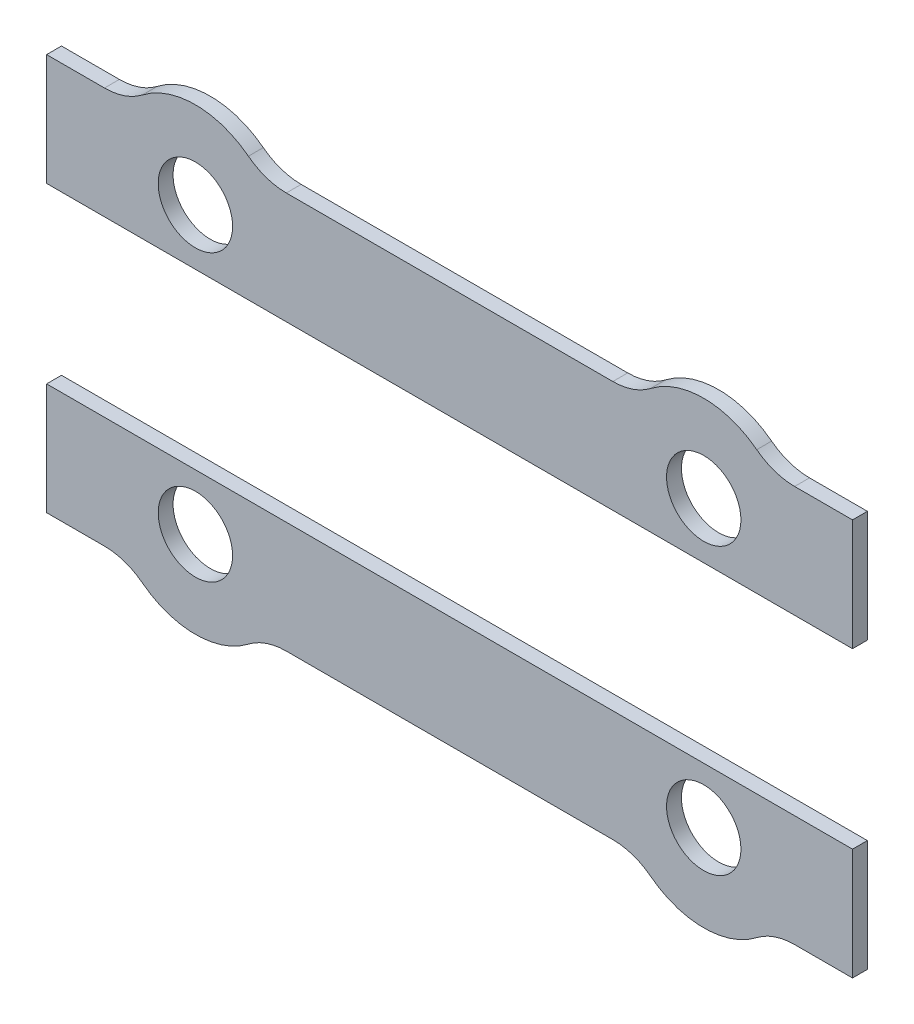
ISO-10303-21;
HEADER;
FILE_DESCRIPTION(('STEP AP214'),'2;1');
FILE_NAME('part.step','',(''),(''),'','','');
FILE_SCHEMA(('AUTOMOTIVE_DESIGN { 1 0 10303 214 1 1 1 1 }'));
ENDSEC;
DATA;
#1=APPLICATION_CONTEXT('core data for automotive mechanical design processes');
#2=APPLICATION_PROTOCOL_DEFINITION('international standard','automotive_design',2000,#1);
#3=PRODUCT_CONTEXT('',#1,'mechanical');
#4=PRODUCT('Part','Part','',(#3));
#5=PRODUCT_RELATED_PRODUCT_CATEGORY('part','',(#4));
#6=PRODUCT_DEFINITION_FORMATION('','',#4);
#7=PRODUCT_DEFINITION_CONTEXT('part definition',#1,'design');
#8=PRODUCT_DEFINITION('design','',#6,#7);
#9=PRODUCT_DEFINITION_SHAPE('','',#8);
#10=(LENGTH_UNIT() NAMED_UNIT(*) SI_UNIT(.MILLI.,.METRE.));
#11=(NAMED_UNIT(*) PLANE_ANGLE_UNIT() SI_UNIT($,.RADIAN.));
#12=(NAMED_UNIT(*) SI_UNIT($,.STERADIAN.) SOLID_ANGLE_UNIT());
#13=UNCERTAINTY_MEASURE_WITH_UNIT(LENGTH_MEASURE(1.E-05),#10,'distance_accuracy_value','');
#14=(GEOMETRIC_REPRESENTATION_CONTEXT(3) GLOBAL_UNCERTAINTY_ASSIGNED_CONTEXT((#13)) GLOBAL_UNIT_ASSIGNED_CONTEXT((#10,
#11,#12)) REPRESENTATION_CONTEXT('',''));
#15=CARTESIAN_POINT('',(0.,0.,0.));
#16=DIRECTION('',(0.,0.,1.));
#17=DIRECTION('',(1.,0.,0.));
#18=AXIS2_PLACEMENT_3D('',#15,#16,#17);
#19=CARTESIAN_POINT('',(2.33428042534615,-2.5000000000001,0.600000000000001));
#20=DIRECTION('',(0.,0.,-1.));
#21=DIRECTION('',(-1.,0.,0.));
#22=AXIS2_PLACEMENT_3D('',#19,#20,#21);
#23=CYLINDRICAL_SURFACE('',#22,2.50000000000005);
#24=CARTESIAN_POINT('',(2.33428042534615,-2.5000000000001,0.));
#25=DIRECTION('',(0.,0.,1.));
#26=DIRECTION('',(1.,0.,0.));
#27=AXIS2_PLACEMENT_3D('',#24,#25,#26);
#28=CIRCLE('',#27,2.50000000000005);
#29=CARTESIAN_POINT('',(2.33428042534621,0.,0.));
#30=VERTEX_POINT('',#29);
#31=CARTESIAN_POINT('',(3.86166358145177,-0.520833333333284,0.));
#32=VERTEX_POINT('',#31);
#33=EDGE_CURVE('E175',#30,#32,#28,.F.);
#34=ORIENTED_EDGE('',*,*,#33,.T.);
#35=DIRECTION('',(0.,0.,-1.));
#36=VECTOR('',#35,1.);
#37=CARTESIAN_POINT('',(3.86166358145177,-0.520833333333284,0.600000000000001));
#38=LINE('',#37,#36);
#39=CARTESIAN_POINT('',(3.86166358145177,-0.520833333333284,0.600000000000001));
#40=VERTEX_POINT('',#39);
#41=EDGE_CURVE('E12',#40,#32,#38,.T.);
#42=ORIENTED_EDGE('',*,*,#41,.F.);
#43=CARTESIAN_POINT('',(2.33428042534615,-2.5000000000001,0.600000000000001));
#44=DIRECTION('',(0.,0.,1.));
#45=DIRECTION('',(1.,0.,0.));
#46=AXIS2_PLACEMENT_3D('',#43,#44,#45);
#47=CIRCLE('',#46,2.50000000000005);
#48=CARTESIAN_POINT('',(2.33428042534621,0.,0.600000000000001));
#49=VERTEX_POINT('',#48);
#50=EDGE_CURVE('E114',#49,#40,#47,.F.);
#51=ORIENTED_EDGE('',*,*,#50,.F.);
#52=DIRECTION('',(0.,0.,-1.));
#53=VECTOR('',#52,1.);
#54=CARTESIAN_POINT('',(2.33428042534621,0.,0.600000000000001));
#55=LINE('',#54,#53);
#56=EDGE_CURVE('E171',#49,#30,#55,.T.);
#57=ORIENTED_EDGE('',*,*,#56,.T.);
#58=EDGE_LOOP('',(#34,#42,#51,#57));
#59=FACE_BOUND('',#58,.T.);
#60=ADVANCED_FACE('F46',(#59),#23,.F.);
#61=CARTESIAN_POINT('',(5.99999999999988,2.25000000000057,0.600000000000001));
#62=DIRECTION('',(0.,0.,-1.));
#63=DIRECTION('',(-1.,0.,0.));
#64=AXIS2_PLACEMENT_3D('',#61,#62,#63);
#65=CYLINDRICAL_SURFACE('',#64,3.50000000000045);
#66=CARTESIAN_POINT('',(5.99999999999988,2.25000000000057,0.));
#67=DIRECTION('',(0.,0.,1.));
#68=DIRECTION('',(1.,0.,0.));
#69=AXIS2_PLACEMENT_3D('',#66,#67,#68);
#70=CIRCLE('',#69,3.50000000000045);
#71=CARTESIAN_POINT('',(8.13833641854802,-0.520833333333259,0.));
#72=VERTEX_POINT('',#71);
#73=EDGE_CURVE('E178',#72,#32,#70,.F.);
#74=ORIENTED_EDGE('',*,*,#73,.F.);
#75=DIRECTION('',(0.,0.,-1.));
#76=VECTOR('',#75,1.);
#77=CARTESIAN_POINT('',(8.13833641854802,-0.520833333333259,0.600000000000001));
#78=LINE('',#77,#76);
#79=CARTESIAN_POINT('',(8.13833641854802,-0.520833333333259,0.600000000000001));
#80=VERTEX_POINT('',#79);
#81=EDGE_CURVE('E55',#80,#72,#78,.T.);
#82=ORIENTED_EDGE('',*,*,#81,.F.);
#83=CARTESIAN_POINT('',(5.99999999999988,2.25000000000057,0.600000000000001));
#84=DIRECTION('',(0.,0.,1.));
#85=DIRECTION('',(1.,0.,0.));
#86=AXIS2_PLACEMENT_3D('',#83,#84,#85);
#87=CIRCLE('',#86,3.50000000000045);
#88=EDGE_CURVE('E364',#80,#40,#87,.F.);
#89=ORIENTED_EDGE('',*,*,#88,.T.);
#90=ORIENTED_EDGE('',*,*,#41,.T.);
#91=EDGE_LOOP('',(#74,#82,#89,#90));
#92=FACE_BOUND('',#91,.T.);
#93=ADVANCED_FACE('F232',(#92),#65,.T.);
#94=CARTESIAN_POINT('',(9.66571957465385,-2.5000000000003,0.600000000000001));
#95=DIRECTION('',(0.,0.,-1.));
#96=DIRECTION('',(-1.,0.,0.));
#97=AXIS2_PLACEMENT_3D('',#94,#95,#96);
#98=CYLINDRICAL_SURFACE('',#97,2.50000000000034);
#99=CARTESIAN_POINT('',(9.66571957465385,-2.5000000000003,0.));
#100=DIRECTION('',(0.,0.,1.));
#101=DIRECTION('',(1.,0.,0.));
#102=AXIS2_PLACEMENT_3D('',#99,#100,#101);
#103=CIRCLE('',#102,2.50000000000034);
#104=CARTESIAN_POINT('',(9.66571957465385,0.,0.));
#105=VERTEX_POINT('',#104);
#106=EDGE_CURVE('E181',#105,#72,#103,.T.);
#107=ORIENTED_EDGE('',*,*,#106,.F.);
#108=DIRECTION('',(0.,0.,-1.));
#109=VECTOR('',#108,1.);
#110=CARTESIAN_POINT('',(9.66571957465385,0.,0.600000000000001));
#111=LINE('',#110,#109);
#112=CARTESIAN_POINT('',(9.66571957465385,0.,0.600000000000001));
#113=VERTEX_POINT('',#112);
#114=EDGE_CURVE('E222',#113,#105,#111,.T.);
#115=ORIENTED_EDGE('',*,*,#114,.F.);
#116=CARTESIAN_POINT('',(9.66571957465385,-2.5000000000003,0.600000000000001));
#117=DIRECTION('',(0.,0.,1.));
#118=DIRECTION('',(1.,0.,0.));
#119=AXIS2_PLACEMENT_3D('',#116,#117,#118);
#120=CIRCLE('',#119,2.50000000000034);
#121=EDGE_CURVE('E229',#113,#80,#120,.T.);
#122=ORIENTED_EDGE('',*,*,#121,.T.);
#123=ORIENTED_EDGE('',*,*,#81,.T.);
#124=EDGE_LOOP('',(#107,#115,#122,#123));
#125=FACE_BOUND('',#124,.T.);
#126=ADVANCED_FACE('F227',(#125),#98,.F.);
#127=CARTESIAN_POINT('',(0.,0.,0.600000000000001));
#128=DIRECTION('',(0.,1.,0.));
#129=DIRECTION('',(-1.,0.,0.));
#130=AXIS2_PLACEMENT_3D('',#127,#128,#129);
#131=PLANE('',#130);
#132=DIRECTION('',(1.,0.,0.));
#133=VECTOR('',#132,1.);
#134=CARTESIAN_POINT('',(0.,0.,0.));
#135=LINE('',#134,#133);
#136=CARTESIAN_POINT('',(22.8342804346538,0.,0.));
#137=VERTEX_POINT('',#136);
#138=EDGE_CURVE('E184',#105,#137,#135,.T.);
#139=ORIENTED_EDGE('',*,*,#138,.T.);
#140=DIRECTION('',(0.,0.,-1.));
#141=VECTOR('',#140,1.);
#142=CARTESIAN_POINT('',(22.8342804346538,0.,0.600000000000001));
#143=LINE('',#142,#141);
#144=CARTESIAN_POINT('',(22.8342804346538,0.,0.600000000000001));
#145=VERTEX_POINT('',#144);
#146=EDGE_CURVE('E219',#145,#137,#143,.T.);
#147=ORIENTED_EDGE('',*,*,#146,.F.);
#148=DIRECTION('',(1.,0.,0.));
#149=VECTOR('',#148,1.);
#150=CARTESIAN_POINT('',(0.,0.,0.600000000000001));
#151=LINE('',#150,#149);
#152=EDGE_CURVE('E251',#113,#145,#151,.T.);
#153=ORIENTED_EDGE('',*,*,#152,.F.);
#154=ORIENTED_EDGE('',*,*,#114,.T.);
#155=EDGE_LOOP('',(#139,#147,#153,#154));
#156=FACE_BOUND('',#155,.T.);
#157=ADVANCED_FACE('F242',(#156),#131,.F.);
#158=CARTESIAN_POINT('',(22.8342804346538,-2.50000000000031,0.600000000000001));
#159=DIRECTION('',(0.,0.,-1.));
#160=DIRECTION('',(-1.,0.,0.));
#161=AXIS2_PLACEMENT_3D('',#158,#159,#160);
#162=CYLINDRICAL_SURFACE('',#161,2.50000000000034);
#163=CARTESIAN_POINT('',(22.8342804346538,-2.50000000000031,0.));
#164=DIRECTION('',(0.,0.,1.));
#165=DIRECTION('',(1.,0.,0.));
#166=AXIS2_PLACEMENT_3D('',#163,#164,#165);
#167=CIRCLE('',#166,2.50000000000034);
#168=CARTESIAN_POINT('',(24.3616635907597,-0.520833333333261,0.));
#169=VERTEX_POINT('',#168);
#170=EDGE_CURVE('E186',#137,#169,#167,.F.);
#171=ORIENTED_EDGE('',*,*,#170,.T.);
#172=DIRECTION('',(0.,0.,-1.));
#173=VECTOR('',#172,1.);
#174=CARTESIAN_POINT('',(24.3616635907597,-0.520833333333261,0.600000000000001));
#175=LINE('',#174,#173);
#176=CARTESIAN_POINT('',(24.3616635907597,-0.520833333333261,0.600000000000001));
#177=VERTEX_POINT('',#176);
#178=EDGE_CURVE('E216',#177,#169,#175,.T.);
#179=ORIENTED_EDGE('',*,*,#178,.F.);
#180=CARTESIAN_POINT('',(22.8342804346538,-2.50000000000031,0.600000000000001));
#181=DIRECTION('',(0.,0.,1.));
#182=DIRECTION('',(1.,0.,0.));
#183=AXIS2_PLACEMENT_3D('',#180,#181,#182);
#184=CIRCLE('',#183,2.50000000000034);
#185=EDGE_CURVE('E248',#145,#177,#184,.F.);
#186=ORIENTED_EDGE('',*,*,#185,.F.);
#187=ORIENTED_EDGE('',*,*,#146,.T.);
#188=EDGE_LOOP('',(#171,#179,#186,#187));
#189=FACE_BOUND('',#188,.T.);
#190=ADVANCED_FACE('F246',(#189),#162,.F.);
#191=CARTESIAN_POINT('',(26.5000000093078,2.25000000000057,0.600000000000001));
#192=DIRECTION('',(0.,0.,-1.));
#193=DIRECTION('',(-1.,0.,0.));
#194=AXIS2_PLACEMENT_3D('',#191,#192,#193);
#195=CYLINDRICAL_SURFACE('',#194,3.50000000000045);
#196=CARTESIAN_POINT('',(26.5000000093078,2.25000000000057,0.));
#197=DIRECTION('',(0.,0.,1.));
#198=DIRECTION('',(1.,0.,0.));
#199=AXIS2_PLACEMENT_3D('',#196,#197,#198);
#200=CIRCLE('',#199,3.50000000000045);
#201=CARTESIAN_POINT('',(28.6383364278559,-0.520833333333277,0.));
#202=VERTEX_POINT('',#201);
#203=EDGE_CURVE('E188',#169,#202,#200,.T.);
#204=ORIENTED_EDGE('',*,*,#203,.T.);
#205=DIRECTION('',(0.,0.,-1.));
#206=VECTOR('',#205,1.);
#207=CARTESIAN_POINT('',(28.6383364278559,-0.520833333333277,0.600000000000001));
#208=LINE('',#207,#206);
#209=CARTESIAN_POINT('',(28.6383364278559,-0.520833333333277,0.600000000000001));
#210=VERTEX_POINT('',#209);
#211=EDGE_CURVE('E214',#210,#202,#208,.T.);
#212=ORIENTED_EDGE('',*,*,#211,.F.);
#213=CARTESIAN_POINT('',(26.5000000093078,2.25000000000057,0.600000000000001));
#214=DIRECTION('',(0.,0.,1.));
#215=DIRECTION('',(1.,0.,0.));
#216=AXIS2_PLACEMENT_3D('',#213,#214,#215);
#217=CIRCLE('',#216,3.50000000000045);
#218=EDGE_CURVE('E250',#177,#210,#217,.T.);
#219=ORIENTED_EDGE('',*,*,#218,.F.);
#220=ORIENTED_EDGE('',*,*,#178,.T.);
#221=EDGE_LOOP('',(#204,#212,#219,#220));
#222=FACE_BOUND('',#221,.T.);
#223=ADVANCED_FACE('F292',(#222),#195,.T.);
#224=CARTESIAN_POINT('',(30.1657195839615,-2.50000000000009,0.600000000000001));
#225=DIRECTION('',(0.,0.,-1.));
#226=DIRECTION('',(-1.,0.,0.));
#227=AXIS2_PLACEMENT_3D('',#224,#225,#226);
#228=CYLINDRICAL_SURFACE('',#227,2.50000000000004);
#229=CARTESIAN_POINT('',(30.1657195839615,-2.50000000000009,0.));
#230=DIRECTION('',(0.,0.,1.));
#231=DIRECTION('',(1.,0.,0.));
#232=AXIS2_PLACEMENT_3D('',#229,#230,#231);
#233=CIRCLE('',#232,2.50000000000004);
#234=CARTESIAN_POINT('',(30.1657195839615,0.,0.));
#235=VERTEX_POINT('',#234);
#236=EDGE_CURVE('E191',#235,#202,#233,.T.);
#237=ORIENTED_EDGE('',*,*,#236,.F.);
#238=DIRECTION('',(0.,0.,-1.));
#239=VECTOR('',#238,1.);
#240=CARTESIAN_POINT('',(30.1657195839615,0.,0.600000000000001));
#241=LINE('',#240,#239);
#242=CARTESIAN_POINT('',(30.1657195839615,0.,0.600000000000001));
#243=VERTEX_POINT('',#242);
#244=EDGE_CURVE('E212',#243,#235,#241,.T.);
#245=ORIENTED_EDGE('',*,*,#244,.F.);
#246=CARTESIAN_POINT('',(30.1657195839615,-2.50000000000009,0.600000000000001));
#247=DIRECTION('',(0.,0.,1.));
#248=DIRECTION('',(1.,0.,0.));
#249=AXIS2_PLACEMENT_3D('',#246,#247,#248);
#250=CIRCLE('',#249,2.50000000000004);
#251=EDGE_CURVE('E253',#243,#210,#250,.T.);
#252=ORIENTED_EDGE('',*,*,#251,.T.);
#253=ORIENTED_EDGE('',*,*,#211,.T.);
#254=EDGE_LOOP('',(#237,#245,#252,#253));
#255=FACE_BOUND('',#254,.T.);
#256=ADVANCED_FACE('F295',(#255),#228,.F.);
#257=CARTESIAN_POINT('',(0.,-6.76267661095971E-13,0.600000000000001));
#258=DIRECTION('',(0.,-1.,0.));
#259=DIRECTION('',(1.,0.,0.));
#260=AXIS2_PLACEMENT_3D('',#257,#258,#259);
#261=PLANE('',#260);
#262=DIRECTION('',(-1.,0.,0.));
#263=VECTOR('',#262,1.);
#264=CARTESIAN_POINT('',(0.,-6.76267661095971E-13,0.));
#265=LINE('',#264,#263);
#266=CARTESIAN_POINT('',(32.5000000093077,0.,0.));
#267=VERTEX_POINT('',#266);
#268=EDGE_CURVE('E194',#267,#235,#265,.T.);
#269=ORIENTED_EDGE('',*,*,#268,.F.);
#270=DIRECTION('',(0.,0.,-1.));
#271=VECTOR('',#270,1.);
#272=CARTESIAN_POINT('',(32.5000000093077,0.,0.600000000000001));
#273=LINE('',#272,#271);
#274=CARTESIAN_POINT('',(32.5000000093077,0.,0.600000000000001));
#275=VERTEX_POINT('',#274);
#276=EDGE_CURVE('E210',#275,#267,#273,.T.);
#277=ORIENTED_EDGE('',*,*,#276,.F.);
#278=DIRECTION('',(-1.,0.,0.));
#279=VECTOR('',#278,1.);
#280=CARTESIAN_POINT('',(0.,-6.76267661095971E-13,0.600000000000001));
#281=LINE('',#280,#279);
#282=EDGE_CURVE('E163',#275,#243,#281,.T.);
#283=ORIENTED_EDGE('',*,*,#282,.T.);
#284=ORIENTED_EDGE('',*,*,#244,.T.);
#285=EDGE_LOOP('',(#269,#277,#283,#284));
#286=FACE_BOUND('',#285,.T.);
#287=ADVANCED_FACE('F262',(#286),#261,.T.);
#288=CARTESIAN_POINT('',(32.5000000093077,0.,0.600000000000001));
#289=DIRECTION('',(1.,0.,0.));
#290=DIRECTION('',(0.,0.,-1.));
#291=AXIS2_PLACEMENT_3D('',#288,#289,#290);
#292=PLANE('',#291);
#293=DIRECTION('',(0.,-1.,0.));
#294=VECTOR('',#293,1.);
#295=CARTESIAN_POINT('',(32.5000000093077,0.,0.));
#296=LINE('',#295,#294);
#297=CARTESIAN_POINT('',(32.5000000093077,4.5,0.));
#298=VERTEX_POINT('',#297);
#299=EDGE_CURVE('E197',#298,#267,#296,.T.);
#300=ORIENTED_EDGE('',*,*,#299,.F.);
#301=DIRECTION('',(0.,0.,-1.));
#302=VECTOR('',#301,1.);
#303=CARTESIAN_POINT('',(32.5000000093077,4.5,0.600000000000001));
#304=LINE('',#303,#302);
#305=CARTESIAN_POINT('',(32.5000000093077,4.5,0.600000000000001));
#306=VERTEX_POINT('',#305);
#307=EDGE_CURVE('E150',#306,#298,#304,.T.);
#308=ORIENTED_EDGE('',*,*,#307,.F.);
#309=DIRECTION('',(0.,-1.,0.));
#310=VECTOR('',#309,1.);
#311=CARTESIAN_POINT('',(32.5000000093077,0.,0.600000000000001));
#312=LINE('',#311,#310);
#313=EDGE_CURVE('E161',#306,#275,#312,.T.);
#314=ORIENTED_EDGE('',*,*,#313,.T.);
#315=ORIENTED_EDGE('',*,*,#276,.T.);
#316=EDGE_LOOP('',(#300,#308,#314,#315));
#317=FACE_BOUND('',#316,.T.);
#318=ADVANCED_FACE('F267',(#317),#292,.T.);
#319=CARTESIAN_POINT('',(0.,4.5,0.600000000000001));
#320=DIRECTION('',(0.,1.,0.));
#321=DIRECTION('',(0.,0.,1.));
#322=AXIS2_PLACEMENT_3D('',#319,#320,#321);
#323=PLANE('',#322);
#324=DIRECTION('',(1.,0.,0.));
#325=VECTOR('',#324,1.);
#326=CARTESIAN_POINT('',(0.,4.5,0.));
#327=LINE('',#326,#325);
#328=CARTESIAN_POINT('',(0.,4.5,0.));
#329=VERTEX_POINT('',#328);
#330=EDGE_CURVE('E149',#329,#298,#327,.T.);
#331=ORIENTED_EDGE('',*,*,#330,.F.);
#332=DIRECTION('',(0.,0.,-1.));
#333=VECTOR('',#332,1.);
#334=CARTESIAN_POINT('',(0.,4.5,0.600000000000001));
#335=LINE('',#334,#333);
#336=CARTESIAN_POINT('',(0.,4.5,0.600000000000001));
#337=VERTEX_POINT('',#336);
#338=EDGE_CURVE('E143',#337,#329,#335,.T.);
#339=ORIENTED_EDGE('',*,*,#338,.F.);
#340=DIRECTION('',(1.,0.,0.));
#341=VECTOR('',#340,1.);
#342=CARTESIAN_POINT('',(0.,4.5,0.600000000000001));
#343=LINE('',#342,#341);
#344=EDGE_CURVE('E147',#337,#306,#343,.T.);
#345=ORIENTED_EDGE('',*,*,#344,.T.);
#346=ORIENTED_EDGE('',*,*,#307,.T.);
#347=EDGE_LOOP('',(#331,#339,#345,#346));
#348=FACE_BOUND('',#347,.T.);
#349=ADVANCED_FACE('F145',(#348),#323,.T.);
#350=CARTESIAN_POINT('',(0.,0.,0.600000000000001));
#351=DIRECTION('',(1.,0.,0.));
#352=DIRECTION('',(0.,0.,-1.));
#353=AXIS2_PLACEMENT_3D('',#350,#351,#352);
#354=PLANE('',#353);
#355=DIRECTION('',(0.,-1.,0.));
#356=VECTOR('',#355,1.);
#357=CARTESIAN_POINT('',(0.,0.,0.));
#358=LINE('',#357,#356);
#359=CARTESIAN_POINT('',(0.,0.,0.));
#360=VERTEX_POINT('',#359);
#361=EDGE_CURVE('E102',#329,#360,#358,.T.);
#362=ORIENTED_EDGE('',*,*,#361,.T.);
#363=DIRECTION('',(0.,0.,-1.));
#364=VECTOR('',#363,1.);
#365=CARTESIAN_POINT('',(0.,0.,0.600000000000001));
#366=LINE('',#365,#364);
#367=CARTESIAN_POINT('',(0.,0.,0.600000000000001));
#368=VERTEX_POINT('',#367);
#369=EDGE_CURVE('E151',#368,#360,#366,.T.);
#370=ORIENTED_EDGE('',*,*,#369,.F.);
#371=DIRECTION('',(0.,-1.,0.));
#372=VECTOR('',#371,1.);
#373=CARTESIAN_POINT('',(0.,0.,0.600000000000001));
#374=LINE('',#373,#372);
#375=EDGE_CURVE('E153',#337,#368,#374,.T.);
#376=ORIENTED_EDGE('',*,*,#375,.F.);
#377=ORIENTED_EDGE('',*,*,#338,.T.);
#378=EDGE_LOOP('',(#362,#370,#376,#377));
#379=FACE_BOUND('',#378,.T.);
#380=ADVANCED_FACE('F154',(#379),#354,.F.);
#381=CARTESIAN_POINT('',(0.,0.,0.600000000000001));
#382=DIRECTION('',(0.,1.,0.));
#383=DIRECTION('',(-1.,0.,0.));
#384=AXIS2_PLACEMENT_3D('',#381,#382,#383);
#385=PLANE('',#384);
#386=DIRECTION('',(1.,0.,0.));
#387=VECTOR('',#386,1.);
#388=CARTESIAN_POINT('',(0.,0.,0.));
#389=LINE('',#388,#387);
#390=EDGE_CURVE('E108',#360,#30,#389,.T.);
#391=ORIENTED_EDGE('',*,*,#390,.T.);
#392=ORIENTED_EDGE('',*,*,#56,.F.);
#393=DIRECTION('',(1.,0.,0.));
#394=VECTOR('',#393,1.);
#395=CARTESIAN_POINT('',(0.,0.,0.600000000000001));
#396=LINE('',#395,#394);
#397=EDGE_CURVE('E63',#368,#49,#396,.T.);
#398=ORIENTED_EDGE('',*,*,#397,.F.);
#399=ORIENTED_EDGE('',*,*,#369,.T.);
#400=EDGE_LOOP('',(#391,#392,#398,#399));
#401=FACE_BOUND('',#400,.T.);
#402=ADVANCED_FACE('F269',(#401),#385,.F.);
#403=CARTESIAN_POINT('',(5.99999999999988,2.25000000000057,0.600000000000001));
#404=DIRECTION('',(0.,0.,-1.));
#405=DIRECTION('',(-1.,0.,0.));
#406=AXIS2_PLACEMENT_3D('',#403,#404,#405);
#407=CYLINDRICAL_SURFACE('',#406,1.5);
#408=CARTESIAN_POINT('',(5.99999999999988,2.25000000000057,0.600000000000001));
#409=DIRECTION('',(0.,0.,1.));
#410=DIRECTION('',(1.,0.,0.));
#411=AXIS2_PLACEMENT_3D('',#408,#409,#410);
#412=CIRCLE('',#411,1.5);
#413=CARTESIAN_POINT('',(7.49999999999988,2.25000000000057,0.600000000000001));
#414=VERTEX_POINT('',#413);
#415=EDGE_CURVE('E206',#414,#414,#412,.T.);
#416=ORIENTED_EDGE('',*,*,#415,.T.);
#417=EDGE_LOOP('',(#416));
#418=FACE_BOUND('',#417,.T.);
#419=CARTESIAN_POINT('',(5.99999999999988,2.25000000000057,0.));
#420=DIRECTION('',(0.,0.,1.));
#421=DIRECTION('',(1.,0.,0.));
#422=AXIS2_PLACEMENT_3D('',#419,#420,#421);
#423=CIRCLE('',#422,1.5);
#424=CARTESIAN_POINT('',(7.49999999999988,2.25000000000057,0.));
#425=VERTEX_POINT('',#424);
#426=EDGE_CURVE('E172',#425,#425,#423,.T.);
#427=ORIENTED_EDGE('',*,*,#426,.F.);
#428=EDGE_LOOP('',(#427));
#429=FACE_BOUND('',#428,.T.);
#430=ADVANCED_FACE('F48',(#418,#429),#407,.F.);
#431=CARTESIAN_POINT('',(26.5000000093078,2.25000000000057,0.600000000000001));
#432=DIRECTION('',(0.,0.,-1.));
#433=DIRECTION('',(-1.,0.,0.));
#434=AXIS2_PLACEMENT_3D('',#431,#432,#433);
#435=CYLINDRICAL_SURFACE('',#434,1.5);
#436=CARTESIAN_POINT('',(26.5000000093078,2.25000000000057,0.600000000000001));
#437=DIRECTION('',(0.,0.,1.));
#438=DIRECTION('',(1.,0.,0.));
#439=AXIS2_PLACEMENT_3D('',#436,#437,#438);
#440=CIRCLE('',#439,1.5);
#441=CARTESIAN_POINT('',(28.0000000093078,2.25000000000057,0.600000000000001));
#442=VERTEX_POINT('',#441);
#443=EDGE_CURVE('E168',#442,#442,#440,.F.);
#444=ORIENTED_EDGE('',*,*,#443,.F.);
#445=EDGE_LOOP('',(#444));
#446=FACE_BOUND('',#445,.T.);
#447=CARTESIAN_POINT('',(26.5000000093078,2.25000000000057,0.));
#448=DIRECTION('',(0.,0.,1.));
#449=DIRECTION('',(1.,0.,0.));
#450=AXIS2_PLACEMENT_3D('',#447,#448,#449);
#451=CIRCLE('',#450,1.5);
#452=CARTESIAN_POINT('',(28.0000000093078,2.25000000000057,0.));
#453=VERTEX_POINT('',#452);
#454=EDGE_CURVE('E203',#453,#453,#451,.F.);
#455=ORIENTED_EDGE('',*,*,#454,.T.);
#456=EDGE_LOOP('',(#455));
#457=FACE_BOUND('',#456,.T.);
#458=ADVANCED_FACE('F276',(#446,#457),#435,.F.);
#459=CARTESIAN_POINT('',(0.,0.,0.600000000000001));
#460=DIRECTION('',(0.,0.,1.));
#461=DIRECTION('',(1.,0.,0.));
#462=AXIS2_PLACEMENT_3D('',#459,#460,#461);
#463=PLANE('',#462);
#464=ORIENTED_EDGE('',*,*,#415,.F.);
#465=EDGE_LOOP('',(#464));
#466=FACE_BOUND('',#465,.T.);
#467=ORIENTED_EDGE('',*,*,#50,.T.);
#468=ORIENTED_EDGE('',*,*,#88,.F.);
#469=ORIENTED_EDGE('',*,*,#121,.F.);
#470=ORIENTED_EDGE('',*,*,#152,.T.);
#471=ORIENTED_EDGE('',*,*,#185,.T.);
#472=ORIENTED_EDGE('',*,*,#218,.T.);
#473=ORIENTED_EDGE('',*,*,#251,.F.);
#474=ORIENTED_EDGE('',*,*,#282,.F.);
#475=ORIENTED_EDGE('',*,*,#313,.F.);
#476=ORIENTED_EDGE('',*,*,#344,.F.);
#477=ORIENTED_EDGE('',*,*,#375,.T.);
#478=ORIENTED_EDGE('',*,*,#397,.T.);
#479=EDGE_LOOP('',(#467,#468,#469,#470,#471,#472,#473,#474,#475,#476,#477,#478));
#480=FACE_BOUND('',#479,.T.);
#481=ORIENTED_EDGE('',*,*,#443,.T.);
#482=EDGE_LOOP('',(#481));
#483=FACE_BOUND('',#482,.T.);
#484=ADVANCED_FACE('F157',(#466,#480,#483),#463,.T.);
#485=CARTESIAN_POINT('',(0.,0.,0.));
#486=DIRECTION('',(0.,0.,1.));
#487=DIRECTION('',(1.,0.,0.));
#488=AXIS2_PLACEMENT_3D('',#485,#486,#487);
#489=PLANE('',#488);
#490=ORIENTED_EDGE('',*,*,#426,.T.);
#491=EDGE_LOOP('',(#490));
#492=FACE_BOUND('',#491,.T.);
#493=ORIENTED_EDGE('',*,*,#33,.F.);
#494=ORIENTED_EDGE('',*,*,#390,.F.);
#495=ORIENTED_EDGE('',*,*,#361,.F.);
#496=ORIENTED_EDGE('',*,*,#330,.T.);
#497=ORIENTED_EDGE('',*,*,#299,.T.);
#498=ORIENTED_EDGE('',*,*,#268,.T.);
#499=ORIENTED_EDGE('',*,*,#236,.T.);
#500=ORIENTED_EDGE('',*,*,#203,.F.);
#501=ORIENTED_EDGE('',*,*,#170,.F.);
#502=ORIENTED_EDGE('',*,*,#138,.F.);
#503=ORIENTED_EDGE('',*,*,#106,.T.);
#504=ORIENTED_EDGE('',*,*,#73,.T.);
#505=EDGE_LOOP('',(#493,#494,#495,#496,#497,#498,#499,#500,#501,#502,#503,#504));
#506=FACE_BOUND('',#505,.T.);
#507=ORIENTED_EDGE('',*,*,#454,.F.);
#508=EDGE_LOOP('',(#507));
#509=FACE_BOUND('',#508,.T.);
#510=ADVANCED_FACE('F236',(#492,#506,#509),#489,.F.);
#511=CLOSED_SHELL('',(#60,#93,#126,#157,#190,#223,#256,#287,#318,#349,#380,#402,#430,#458,#484,#510));
#512=MANIFOLD_SOLID_BREP('B2',#511);
#513=CARTESIAN_POINT('',(0.,15.9999999999999,0.600000000000001));
#514=DIRECTION('',(0.,1.,0.));
#515=DIRECTION('',(-1.,0.,0.));
#516=AXIS2_PLACEMENT_3D('',#513,#514,#515);
#517=PLANE('',#516);
#518=DIRECTION('',(1.,0.,0.));
#519=VECTOR('',#518,1.);
#520=CARTESIAN_POINT('',(0.,15.9999999999999,0.));
#521=LINE('',#520,#519);
#522=CARTESIAN_POINT('',(9.66571957465385,15.9999999999999,0.));
#523=VERTEX_POINT('',#522);
#524=CARTESIAN_POINT('',(22.8342804346538,16.,0.));
#525=VERTEX_POINT('',#524);
#526=EDGE_CURVE('E574',#523,#525,#521,.T.);
#527=ORIENTED_EDGE('',*,*,#526,.F.);
#528=DIRECTION('',(0.,0.,-1.));
#529=VECTOR('',#528,1.);
#530=CARTESIAN_POINT('',(9.66571957465385,15.9999999999999,0.600000000000001));
#531=LINE('',#530,#529);
#532=CARTESIAN_POINT('',(9.66571957465385,15.9999999999999,0.600000000000001));
#533=VERTEX_POINT('',#532);
#534=EDGE_CURVE('E44',#533,#523,#531,.T.);
#535=ORIENTED_EDGE('',*,*,#534,.F.);
#536=DIRECTION('',(1.,0.,0.));
#537=VECTOR('',#536,1.);
#538=CARTESIAN_POINT('',(0.,15.9999999999999,0.600000000000001));
#539=LINE('',#538,#537);
#540=CARTESIAN_POINT('',(22.8342804346538,16.,0.600000000000001));
#541=VERTEX_POINT('',#540);
#542=EDGE_CURVE('E692',#533,#541,#539,.T.);
#543=ORIENTED_EDGE('',*,*,#542,.T.);
#544=DIRECTION('',(0.,0.,-1.));
#545=VECTOR('',#544,1.);
#546=CARTESIAN_POINT('',(22.8342804346538,16.,0.600000000000001));
#547=LINE('',#546,#545);
#548=EDGE_CURVE('E466',#541,#525,#547,.T.);
#549=ORIENTED_EDGE('',*,*,#548,.T.);
#550=EDGE_LOOP('',(#527,#535,#543,#549));
#551=FACE_BOUND('',#550,.T.);
#552=ADVANCED_FACE('F449',(#551),#517,.T.);
#553=CARTESIAN_POINT('',(9.66571957465385,18.5000000000003,0.600000000000001));
#554=DIRECTION('',(0.,0.,-1.));
#555=DIRECTION('',(-1.,0.,0.));
#556=AXIS2_PLACEMENT_3D('',#553,#554,#555);
#557=CYLINDRICAL_SURFACE('',#556,2.50000000000034);
#558=CARTESIAN_POINT('',(9.66571957465385,18.5000000000003,0.));
#559=DIRECTION('',(0.,0.,1.));
#560=DIRECTION('',(1.,0.,0.));
#561=AXIS2_PLACEMENT_3D('',#558,#559,#560);
#562=CIRCLE('',#561,2.50000000000034);
#563=CARTESIAN_POINT('',(8.13833641854802,16.5208333333332,0.));
#564=VERTEX_POINT('',#563);
#565=EDGE_CURVE('E576',#523,#564,#562,.F.);
#566=ORIENTED_EDGE('',*,*,#565,.T.);
#567=DIRECTION('',(0.,0.,-1.));
#568=VECTOR('',#567,1.);
#569=CARTESIAN_POINT('',(8.13833641854802,16.5208333333332,0.600000000000001));
#570=LINE('',#569,#568);
#571=CARTESIAN_POINT('',(8.13833641854802,16.5208333333332,0.600000000000001));
#572=VERTEX_POINT('',#571);
#573=EDGE_CURVE('E458',#572,#564,#570,.T.);
#574=ORIENTED_EDGE('',*,*,#573,.F.);
#575=CARTESIAN_POINT('',(9.66571957465385,18.5000000000003,0.600000000000001));
#576=DIRECTION('',(0.,0.,1.));
#577=DIRECTION('',(1.,0.,0.));
#578=AXIS2_PLACEMENT_3D('',#575,#576,#577);
#579=CIRCLE('',#578,2.50000000000034);
#580=EDGE_CURVE('E694',#533,#572,#579,.F.);
#581=ORIENTED_EDGE('',*,*,#580,.F.);
#582=ORIENTED_EDGE('',*,*,#534,.T.);
#583=EDGE_LOOP('',(#566,#574,#581,#582));
#584=FACE_BOUND('',#583,.T.);
#585=ADVANCED_FACE('F635',(#584),#557,.F.);
#586=CARTESIAN_POINT('',(5.99999999999988,13.7499999999994,0.600000000000001));
#587=DIRECTION('',(0.,0.,-1.));
#588=DIRECTION('',(-1.,0.,0.));
#589=AXIS2_PLACEMENT_3D('',#586,#587,#588);
#590=CYLINDRICAL_SURFACE('',#589,3.50000000000044);
#591=CARTESIAN_POINT('',(5.99999999999988,13.7499999999994,0.));
#592=DIRECTION('',(0.,0.,1.));
#593=DIRECTION('',(1.,0.,0.));
#594=AXIS2_PLACEMENT_3D('',#591,#592,#593);
#595=CIRCLE('',#594,3.50000000000044);
#596=CARTESIAN_POINT('',(3.86166358145177,16.5208333333333,0.));
#597=VERTEX_POINT('',#596);
#598=EDGE_CURVE('E579',#564,#597,#595,.T.);
#599=ORIENTED_EDGE('',*,*,#598,.T.);
#600=DIRECTION('',(0.,0.,-1.));
#601=VECTOR('',#600,1.);
#602=CARTESIAN_POINT('',(3.86166358145177,16.5208333333333,0.600000000000001));
#603=LINE('',#602,#601);
#604=CARTESIAN_POINT('',(3.86166358145177,16.5208333333333,0.600000000000001));
#605=VERTEX_POINT('',#604);
#606=EDGE_CURVE('E625',#605,#597,#603,.T.);
#607=ORIENTED_EDGE('',*,*,#606,.F.);
#608=CARTESIAN_POINT('',(5.99999999999988,13.7499999999994,0.600000000000001));
#609=DIRECTION('',(0.,0.,1.));
#610=DIRECTION('',(1.,0.,0.));
#611=AXIS2_PLACEMENT_3D('',#608,#609,#610);
#612=CIRCLE('',#611,3.50000000000044);
#613=EDGE_CURVE('E631',#572,#605,#612,.T.);
#614=ORIENTED_EDGE('',*,*,#613,.F.);
#615=ORIENTED_EDGE('',*,*,#573,.T.);
#616=EDGE_LOOP('',(#599,#607,#614,#615));
#617=FACE_BOUND('',#616,.T.);
#618=ADVANCED_FACE('F629',(#617),#590,.T.);
#619=CARTESIAN_POINT('',(2.33428042534615,18.5000000000001,0.600000000000001));
#620=DIRECTION('',(0.,0.,-1.));
#621=DIRECTION('',(-1.,0.,0.));
#622=AXIS2_PLACEMENT_3D('',#619,#620,#621);
#623=CYLINDRICAL_SURFACE('',#622,2.50000000000004);
#624=CARTESIAN_POINT('',(2.33428042534615,18.5000000000001,0.));
#625=DIRECTION('',(0.,0.,1.));
#626=DIRECTION('',(1.,0.,0.));
#627=AXIS2_PLACEMENT_3D('',#624,#625,#626);
#628=CIRCLE('',#627,2.50000000000004);
#629=CARTESIAN_POINT('',(2.33428042534621,16.0000000000001,0.));
#630=VERTEX_POINT('',#629);
#631=EDGE_CURVE('E582',#630,#597,#628,.T.);
#632=ORIENTED_EDGE('',*,*,#631,.F.);
#633=DIRECTION('',(0.,0.,-1.));
#634=VECTOR('',#633,1.);
#635=CARTESIAN_POINT('',(2.33428042534621,16.0000000000001,0.600000000000001));
#636=LINE('',#635,#634);
#637=CARTESIAN_POINT('',(2.33428042534621,16.0000000000001,0.600000000000001));
#638=VERTEX_POINT('',#637);
#639=EDGE_CURVE('E623',#638,#630,#636,.T.);
#640=ORIENTED_EDGE('',*,*,#639,.F.);
#641=CARTESIAN_POINT('',(2.33428042534615,18.5000000000001,0.600000000000001));
#642=DIRECTION('',(0.,0.,1.));
#643=DIRECTION('',(1.,0.,0.));
#644=AXIS2_PLACEMENT_3D('',#641,#642,#643);
#645=CIRCLE('',#644,2.50000000000004);
#646=EDGE_CURVE('E699',#638,#605,#645,.T.);
#647=ORIENTED_EDGE('',*,*,#646,.T.);
#648=ORIENTED_EDGE('',*,*,#606,.T.);
#649=EDGE_LOOP('',(#632,#640,#647,#648));
#650=FACE_BOUND('',#649,.T.);
#651=ADVANCED_FACE('F647',(#650),#623,.F.);
#652=CARTESIAN_POINT('',(-4.04274293989943E-13,16.,0.600000000000001));
#653=DIRECTION('',(0.,1.,0.));
#654=DIRECTION('',(-1.,0.,0.));
#655=AXIS2_PLACEMENT_3D('',#652,#653,#654);
#656=PLANE('',#655);
#657=DIRECTION('',(1.,0.,0.));
#658=VECTOR('',#657,1.);
#659=CARTESIAN_POINT('',(-4.04274293989943E-13,16.,0.));
#660=LINE('',#659,#658);
#661=CARTESIAN_POINT('',(0.,16.,0.));
#662=VERTEX_POINT('',#661);
#663=EDGE_CURVE('E585',#662,#630,#660,.T.);
#664=ORIENTED_EDGE('',*,*,#663,.F.);
#665=DIRECTION('',(0.,0.,-1.));
#666=VECTOR('',#665,1.);
#667=CARTESIAN_POINT('',(0.,16.,0.600000000000001));
#668=LINE('',#667,#666);
#669=CARTESIAN_POINT('',(0.,16.,0.600000000000001));
#670=VERTEX_POINT('',#669);
#671=EDGE_CURVE('E621',#670,#662,#668,.T.);
#672=ORIENTED_EDGE('',*,*,#671,.F.);
#673=DIRECTION('',(1.,0.,0.));
#674=VECTOR('',#673,1.);
#675=CARTESIAN_POINT('',(-4.04274293989943E-13,16.,0.600000000000001));
#676=LINE('',#675,#674);
#677=EDGE_CURVE('E702',#670,#638,#676,.T.);
#678=ORIENTED_EDGE('',*,*,#677,.T.);
#679=ORIENTED_EDGE('',*,*,#639,.T.);
#680=EDGE_LOOP('',(#664,#672,#678,#679));
#681=FACE_BOUND('',#680,.T.);
#682=ADVANCED_FACE('F650',(#681),#656,.T.);
#683=CARTESIAN_POINT('',(0.,0.,0.600000000000001));
#684=DIRECTION('',(-1.,0.,0.));
#685=DIRECTION('',(0.,0.,1.));
#686=AXIS2_PLACEMENT_3D('',#683,#684,#685);
#687=PLANE('',#686);
#688=DIRECTION('',(0.,1.,0.));
#689=VECTOR('',#688,1.);
#690=CARTESIAN_POINT('',(0.,0.,0.));
#691=LINE('',#690,#689);
#692=CARTESIAN_POINT('',(0.,11.5,0.));
#693=VERTEX_POINT('',#692);
#694=EDGE_CURVE('E588',#693,#662,#691,.T.);
#695=ORIENTED_EDGE('',*,*,#694,.F.);
#696=DIRECTION('',(0.,0.,-1.));
#697=VECTOR('',#696,1.);
#698=CARTESIAN_POINT('',(0.,11.5,0.600000000000001));
#699=LINE('',#698,#697);
#700=CARTESIAN_POINT('',(0.,11.5,0.600000000000001));
#701=VERTEX_POINT('',#700);
#702=EDGE_CURVE('E619',#701,#693,#699,.T.);
#703=ORIENTED_EDGE('',*,*,#702,.F.);
#704=DIRECTION('',(0.,1.,0.));
#705=VECTOR('',#704,1.);
#706=CARTESIAN_POINT('',(0.,0.,0.600000000000001));
#707=LINE('',#706,#705);
#708=EDGE_CURVE('E705',#701,#670,#707,.T.);
#709=ORIENTED_EDGE('',*,*,#708,.T.);
#710=ORIENTED_EDGE('',*,*,#671,.T.);
#711=EDGE_LOOP('',(#695,#703,#709,#710));
#712=FACE_BOUND('',#711,.T.);
#713=ADVANCED_FACE('F654',(#712),#687,.T.);
#714=CARTESIAN_POINT('',(0.,11.5,0.600000000000001));
#715=DIRECTION('',(0.,1.,0.));
#716=DIRECTION('',(0.,0.,1.));
#717=AXIS2_PLACEMENT_3D('',#714,#715,#716);
#718=PLANE('',#717);
#719=DIRECTION('',(1.,0.,0.));
#720=VECTOR('',#719,1.);
#721=CARTESIAN_POINT('',(0.,11.5,0.));
#722=LINE('',#721,#720);
#723=CARTESIAN_POINT('',(32.5000000093077,11.5,0.));
#724=VERTEX_POINT('',#723);
#725=EDGE_CURVE('E591',#693,#724,#722,.T.);
#726=ORIENTED_EDGE('',*,*,#725,.T.);
#727=DIRECTION('',(0.,0.,-1.));
#728=VECTOR('',#727,1.);
#729=CARTESIAN_POINT('',(32.5000000093077,11.5,0.600000000000001));
#730=LINE('',#729,#728);
#731=CARTESIAN_POINT('',(32.5000000093077,11.5,0.600000000000001));
#732=VERTEX_POINT('',#731);
#733=EDGE_CURVE('E616',#732,#724,#730,.T.);
#734=ORIENTED_EDGE('',*,*,#733,.F.);
#735=DIRECTION('',(1.,0.,0.));
#736=VECTOR('',#735,1.);
#737=CARTESIAN_POINT('',(0.,11.5,0.600000000000001));
#738=LINE('',#737,#736);
#739=EDGE_CURVE('E708',#701,#732,#738,.T.);
#740=ORIENTED_EDGE('',*,*,#739,.F.);
#741=ORIENTED_EDGE('',*,*,#702,.T.);
#742=EDGE_LOOP('',(#726,#734,#740,#741));
#743=FACE_BOUND('',#742,.T.);
#744=ADVANCED_FACE('F658',(#743),#718,.F.);
#745=CARTESIAN_POINT('',(32.5000000093077,0.,0.600000000000001));
#746=DIRECTION('',(-1.,0.,0.));
#747=DIRECTION('',(0.,0.,1.));
#748=AXIS2_PLACEMENT_3D('',#745,#746,#747);
#749=PLANE('',#748);
#750=DIRECTION('',(0.,1.,0.));
#751=VECTOR('',#750,1.);
#752=CARTESIAN_POINT('',(32.5000000093077,0.,0.));
#753=LINE('',#752,#751);
#754=CARTESIAN_POINT('',(32.5000000093077,16.,0.));
#755=VERTEX_POINT('',#754);
#756=EDGE_CURVE('E594',#724,#755,#753,.T.);
#757=ORIENTED_EDGE('',*,*,#756,.T.);
#758=DIRECTION('',(0.,0.,-1.));
#759=VECTOR('',#758,1.);
#760=CARTESIAN_POINT('',(32.5000000093077,16.,0.600000000000001));
#761=LINE('',#760,#759);
#762=CARTESIAN_POINT('',(32.5000000093077,16.,0.600000000000001));
#763=VERTEX_POINT('',#762);
#764=EDGE_CURVE('E613',#763,#755,#761,.T.);
#765=ORIENTED_EDGE('',*,*,#764,.F.);
#766=DIRECTION('',(0.,1.,0.));
#767=VECTOR('',#766,1.);
#768=CARTESIAN_POINT('',(32.5000000093077,0.,0.600000000000001));
#769=LINE('',#768,#767);
#770=EDGE_CURVE('E711',#732,#763,#769,.T.);
#771=ORIENTED_EDGE('',*,*,#770,.F.);
#772=ORIENTED_EDGE('',*,*,#733,.T.);
#773=EDGE_LOOP('',(#757,#765,#771,#772));
#774=FACE_BOUND('',#773,.T.);
#775=ADVANCED_FACE('F662',(#774),#749,.F.);
#776=CARTESIAN_POINT('',(3.32931771521143E-13,16.0000000000007,0.600000000000001));
#777=DIRECTION('',(0.,-1.,0.));
#778=DIRECTION('',(1.,0.,0.));
#779=AXIS2_PLACEMENT_3D('',#776,#777,#778);
#780=PLANE('',#779);
#781=DIRECTION('',(-1.,0.,0.));
#782=VECTOR('',#781,1.);
#783=CARTESIAN_POINT('',(3.32931771521143E-13,16.0000000000007,0.));
#784=LINE('',#783,#782);
#785=CARTESIAN_POINT('',(30.1657195839615,16.,0.));
#786=VERTEX_POINT('',#785);
#787=EDGE_CURVE('E597',#755,#786,#784,.T.);
#788=ORIENTED_EDGE('',*,*,#787,.T.);
#789=DIRECTION('',(0.,0.,-1.));
#790=VECTOR('',#789,1.);
#791=CARTESIAN_POINT('',(30.1657195839615,16.,0.600000000000001));
#792=LINE('',#791,#790);
#793=CARTESIAN_POINT('',(30.1657195839615,16.,0.600000000000001));
#794=VERTEX_POINT('',#793);
#795=EDGE_CURVE('E560',#794,#786,#792,.T.);
#796=ORIENTED_EDGE('',*,*,#795,.F.);
#797=DIRECTION('',(-1.,0.,0.));
#798=VECTOR('',#797,1.);
#799=CARTESIAN_POINT('',(3.32931771521143E-13,16.0000000000007,0.600000000000001));
#800=LINE('',#799,#798);
#801=EDGE_CURVE('E549',#763,#794,#800,.T.);
#802=ORIENTED_EDGE('',*,*,#801,.F.);
#803=ORIENTED_EDGE('',*,*,#764,.T.);
#804=EDGE_LOOP('',(#788,#796,#802,#803));
#805=FACE_BOUND('',#804,.T.);
#806=ADVANCED_FACE('F666',(#805),#780,.F.);
#807=CARTESIAN_POINT('',(30.1657195839615,18.5000000000001,0.600000000000001));
#808=DIRECTION('',(0.,0.,-1.));
#809=DIRECTION('',(-1.,0.,0.));
#810=AXIS2_PLACEMENT_3D('',#807,#808,#809);
#811=CYLINDRICAL_SURFACE('',#810,2.50000000000004);
#812=CARTESIAN_POINT('',(30.1657195839615,18.5000000000001,0.));
#813=DIRECTION('',(0.,0.,1.));
#814=DIRECTION('',(1.,0.,0.));
#815=AXIS2_PLACEMENT_3D('',#812,#813,#814);
#816=CIRCLE('',#815,2.50000000000004);
#817=CARTESIAN_POINT('',(28.6383364278559,16.5208333333333,0.));
#818=VERTEX_POINT('',#817);
#819=EDGE_CURVE('E557',#786,#818,#816,.F.);
#820=ORIENTED_EDGE('',*,*,#819,.T.);
#821=DIRECTION('',(0.,0.,-1.));
#822=VECTOR('',#821,1.);
#823=CARTESIAN_POINT('',(28.6383364278559,16.5208333333333,0.600000000000001));
#824=LINE('',#823,#822);
#825=CARTESIAN_POINT('',(28.6383364278559,16.5208333333333,0.600000000000001));
#826=VERTEX_POINT('',#825);
#827=EDGE_CURVE('E555',#826,#818,#824,.T.);
#828=ORIENTED_EDGE('',*,*,#827,.F.);
#829=CARTESIAN_POINT('',(30.1657195839615,18.5000000000001,0.600000000000001));
#830=DIRECTION('',(0.,0.,1.));
#831=DIRECTION('',(1.,0.,0.));
#832=AXIS2_PLACEMENT_3D('',#829,#830,#831);
#833=CIRCLE('',#832,2.50000000000004);
#834=EDGE_CURVE('E540',#794,#826,#833,.F.);
#835=ORIENTED_EDGE('',*,*,#834,.F.);
#836=ORIENTED_EDGE('',*,*,#795,.T.);
#837=EDGE_LOOP('',(#820,#828,#835,#836));
#838=FACE_BOUND('',#837,.T.);
#839=ADVANCED_FACE('F556',(#838),#811,.F.);
#840=CARTESIAN_POINT('',(26.5000000093078,13.7499999999994,0.600000000000001));
#841=DIRECTION('',(0.,0.,-1.));
#842=DIRECTION('',(-1.,0.,0.));
#843=AXIS2_PLACEMENT_3D('',#840,#841,#842);
#844=CYLINDRICAL_SURFACE('',#843,3.50000000000045);
#845=CARTESIAN_POINT('',(26.5000000093078,13.7499999999994,0.));
#846=DIRECTION('',(0.,0.,1.));
#847=DIRECTION('',(1.,0.,0.));
#848=AXIS2_PLACEMENT_3D('',#845,#846,#847);
#849=CIRCLE('',#848,3.50000000000045);
#850=CARTESIAN_POINT('',(24.3616635907597,16.5208333333333,0.));
#851=VERTEX_POINT('',#850);
#852=EDGE_CURVE('E601',#851,#818,#849,.F.);
#853=ORIENTED_EDGE('',*,*,#852,.F.);
#854=DIRECTION('',(0.,0.,-1.));
#855=VECTOR('',#854,1.);
#856=CARTESIAN_POINT('',(24.3616635907597,16.5208333333333,0.600000000000001));
#857=LINE('',#856,#855);
#858=CARTESIAN_POINT('',(24.3616635907597,16.5208333333333,0.600000000000001));
#859=VERTEX_POINT('',#858);
#860=EDGE_CURVE('E503',#859,#851,#857,.T.);
#861=ORIENTED_EDGE('',*,*,#860,.F.);
#862=CARTESIAN_POINT('',(26.5000000093078,13.7499999999994,0.600000000000001));
#863=DIRECTION('',(0.,0.,1.));
#864=DIRECTION('',(1.,0.,0.));
#865=AXIS2_PLACEMENT_3D('',#862,#863,#864);
#866=CIRCLE('',#865,3.50000000000045);
#867=EDGE_CURVE('E547',#859,#826,#866,.F.);
#868=ORIENTED_EDGE('',*,*,#867,.T.);
#869=ORIENTED_EDGE('',*,*,#827,.T.);
#870=EDGE_LOOP('',(#853,#861,#868,#869));
#871=FACE_BOUND('',#870,.T.);
#872=ADVANCED_FACE('F562',(#871),#844,.T.);
#873=CARTESIAN_POINT('',(22.8342804346538,18.5000000000003,0.600000000000001));
#874=DIRECTION('',(0.,0.,-1.));
#875=DIRECTION('',(-1.,0.,0.));
#876=AXIS2_PLACEMENT_3D('',#873,#874,#875);
#877=CYLINDRICAL_SURFACE('',#876,2.50000000000035);
#878=CARTESIAN_POINT('',(22.8342804346538,18.5000000000003,0.));
#879=DIRECTION('',(0.,0.,1.));
#880=DIRECTION('',(1.,0.,0.));
#881=AXIS2_PLACEMENT_3D('',#878,#879,#880);
#882=CIRCLE('',#881,2.50000000000035);
#883=EDGE_CURVE('E603',#525,#851,#882,.T.);
#884=ORIENTED_EDGE('',*,*,#883,.F.);
#885=ORIENTED_EDGE('',*,*,#548,.F.);
#886=CARTESIAN_POINT('',(22.8342804346538,18.5000000000003,0.600000000000001));
#887=DIRECTION('',(0.,0.,1.));
#888=DIRECTION('',(1.,0.,0.));
#889=AXIS2_PLACEMENT_3D('',#886,#887,#888);
#890=CIRCLE('',#889,2.50000000000035);
#891=EDGE_CURVE('E563',#541,#859,#890,.T.);
#892=ORIENTED_EDGE('',*,*,#891,.T.);
#893=ORIENTED_EDGE('',*,*,#860,.T.);
#894=EDGE_LOOP('',(#884,#885,#892,#893));
#895=FACE_BOUND('',#894,.T.);
#896=ADVANCED_FACE('F675',(#895),#877,.F.);
#897=CARTESIAN_POINT('',(5.99999999999988,13.7499999999994,0.600000000000001));
#898=DIRECTION('',(0.,0.,-1.));
#899=DIRECTION('',(-1.,0.,0.));
#900=AXIS2_PLACEMENT_3D('',#897,#898,#899);
#901=CYLINDRICAL_SURFACE('',#900,1.5);
#902=CARTESIAN_POINT('',(5.99999999999988,13.7499999999994,0.600000000000001));
#903=DIRECTION('',(0.,0.,1.));
#904=DIRECTION('',(1.,0.,0.));
#905=AXIS2_PLACEMENT_3D('',#902,#903,#904);
#906=CIRCLE('',#905,1.5);
#907=CARTESIAN_POINT('',(7.49999999999988,13.7499999999994,0.600000000000001));
#908=VERTEX_POINT('',#907);
#909=EDGE_CURVE('E609',#908,#908,#906,.F.);
#910=ORIENTED_EDGE('',*,*,#909,.F.);
#911=EDGE_LOOP('',(#910));
#912=FACE_BOUND('',#911,.T.);
#913=CARTESIAN_POINT('',(5.99999999999988,13.7499999999994,0.));
#914=DIRECTION('',(0.,0.,1.));
#915=DIRECTION('',(1.,0.,0.));
#916=AXIS2_PLACEMENT_3D('',#913,#914,#915);
#917=CIRCLE('',#916,1.5);
#918=CARTESIAN_POINT('',(7.49999999999988,13.7499999999994,0.));
#919=VERTEX_POINT('',#918);
#920=EDGE_CURVE('E571',#919,#919,#917,.F.);
#921=ORIENTED_EDGE('',*,*,#920,.T.);
#922=EDGE_LOOP('',(#921));
#923=FACE_BOUND('',#922,.T.);
#924=ADVANCED_FACE('F451',(#912,#923),#901,.F.);
#925=CARTESIAN_POINT('',(26.5000000093078,13.7499999999994,0.600000000000001));
#926=DIRECTION('',(0.,0.,-1.));
#927=DIRECTION('',(-1.,0.,0.));
#928=AXIS2_PLACEMENT_3D('',#925,#926,#927);
#929=CYLINDRICAL_SURFACE('',#928,1.5);
#930=CARTESIAN_POINT('',(26.5000000093078,13.7499999999994,0.600000000000001));
#931=DIRECTION('',(0.,0.,1.));
#932=DIRECTION('',(1.,0.,0.));
#933=AXIS2_PLACEMENT_3D('',#930,#931,#932);
#934=CIRCLE('',#933,1.5);
#935=CARTESIAN_POINT('',(28.0000000093078,13.7499999999994,0.600000000000001));
#936=VERTEX_POINT('',#935);
#937=EDGE_CURVE('E565',#936,#936,#934,.T.);
#938=ORIENTED_EDGE('',*,*,#937,.T.);
#939=EDGE_LOOP('',(#938));
#940=FACE_BOUND('',#939,.T.);
#941=CARTESIAN_POINT('',(26.5000000093078,13.7499999999994,0.));
#942=DIRECTION('',(0.,0.,1.));
#943=DIRECTION('',(1.,0.,0.));
#944=AXIS2_PLACEMENT_3D('',#941,#942,#943);
#945=CIRCLE('',#944,1.5);
#946=CARTESIAN_POINT('',(28.0000000093078,13.7499999999994,0.));
#947=VERTEX_POINT('',#946);
#948=EDGE_CURVE('E606',#947,#947,#945,.T.);
#949=ORIENTED_EDGE('',*,*,#948,.F.);
#950=EDGE_LOOP('',(#949));
#951=FACE_BOUND('',#950,.T.);
#952=ADVANCED_FACE('F678',(#940,#951),#929,.F.);
#953=CARTESIAN_POINT('',(0.,0.,0.600000000000001));
#954=DIRECTION('',(0.,0.,1.));
#955=DIRECTION('',(1.,0.,0.));
#956=AXIS2_PLACEMENT_3D('',#953,#954,#955);
#957=PLANE('',#956);
#958=ORIENTED_EDGE('',*,*,#909,.T.);
#959=EDGE_LOOP('',(#958));
#960=FACE_BOUND('',#959,.T.);
#961=ORIENTED_EDGE('',*,*,#542,.F.);
#962=ORIENTED_EDGE('',*,*,#580,.T.);
#963=ORIENTED_EDGE('',*,*,#613,.T.);
#964=ORIENTED_EDGE('',*,*,#646,.F.);
#965=ORIENTED_EDGE('',*,*,#677,.F.);
#966=ORIENTED_EDGE('',*,*,#708,.F.);
#967=ORIENTED_EDGE('',*,*,#739,.T.);
#968=ORIENTED_EDGE('',*,*,#770,.T.);
#969=ORIENTED_EDGE('',*,*,#801,.T.);
#970=ORIENTED_EDGE('',*,*,#834,.T.);
#971=ORIENTED_EDGE('',*,*,#867,.F.);
#972=ORIENTED_EDGE('',*,*,#891,.F.);
#973=EDGE_LOOP('',(#961,#962,#963,#964,#965,#966,#967,#968,#969,#970,#971,#972));
#974=FACE_BOUND('',#973,.T.);
#975=ORIENTED_EDGE('',*,*,#937,.F.);
#976=EDGE_LOOP('',(#975));
#977=FACE_BOUND('',#976,.T.);
#978=ADVANCED_FACE('F543',(#960,#974,#977),#957,.T.);
#979=CARTESIAN_POINT('',(0.,0.,0.));
#980=DIRECTION('',(0.,0.,1.));
#981=DIRECTION('',(1.,0.,0.));
#982=AXIS2_PLACEMENT_3D('',#979,#980,#981);
#983=PLANE('',#982);
#984=ORIENTED_EDGE('',*,*,#920,.F.);
#985=EDGE_LOOP('',(#984));
#986=FACE_BOUND('',#985,.T.);
#987=ORIENTED_EDGE('',*,*,#526,.T.);
#988=ORIENTED_EDGE('',*,*,#883,.T.);
#989=ORIENTED_EDGE('',*,*,#852,.T.);
#990=ORIENTED_EDGE('',*,*,#819,.F.);
#991=ORIENTED_EDGE('',*,*,#787,.F.);
#992=ORIENTED_EDGE('',*,*,#756,.F.);
#993=ORIENTED_EDGE('',*,*,#725,.F.);
#994=ORIENTED_EDGE('',*,*,#694,.T.);
#995=ORIENTED_EDGE('',*,*,#663,.T.);
#996=ORIENTED_EDGE('',*,*,#631,.T.);
#997=ORIENTED_EDGE('',*,*,#598,.F.);
#998=ORIENTED_EDGE('',*,*,#565,.F.);
#999=EDGE_LOOP('',(#987,#988,#989,#990,#991,#992,#993,#994,#995,#996,#997,#998));
#1000=FACE_BOUND('',#999,.T.);
#1001=ORIENTED_EDGE('',*,*,#948,.T.);
#1002=EDGE_LOOP('',(#1001));
#1003=FACE_BOUND('',#1002,.T.);
#1004=ADVANCED_FACE('F637',(#986,#1000,#1003),#983,.F.);
#1005=CLOSED_SHELL('',(#552,#585,#618,#651,#682,#713,#744,#775,#806,#839,#872,#896,#924,#952,
#978,#1004));
#1006=MANIFOLD_SOLID_BREP('B6',#1005);
#1007=ADVANCED_BREP_SHAPE_REPRESENTATION('',(#18,#512,#1006),#14);
#1008=SHAPE_DEFINITION_REPRESENTATION(#9,#1007);
ENDSEC;
END-ISO-10303-21;
